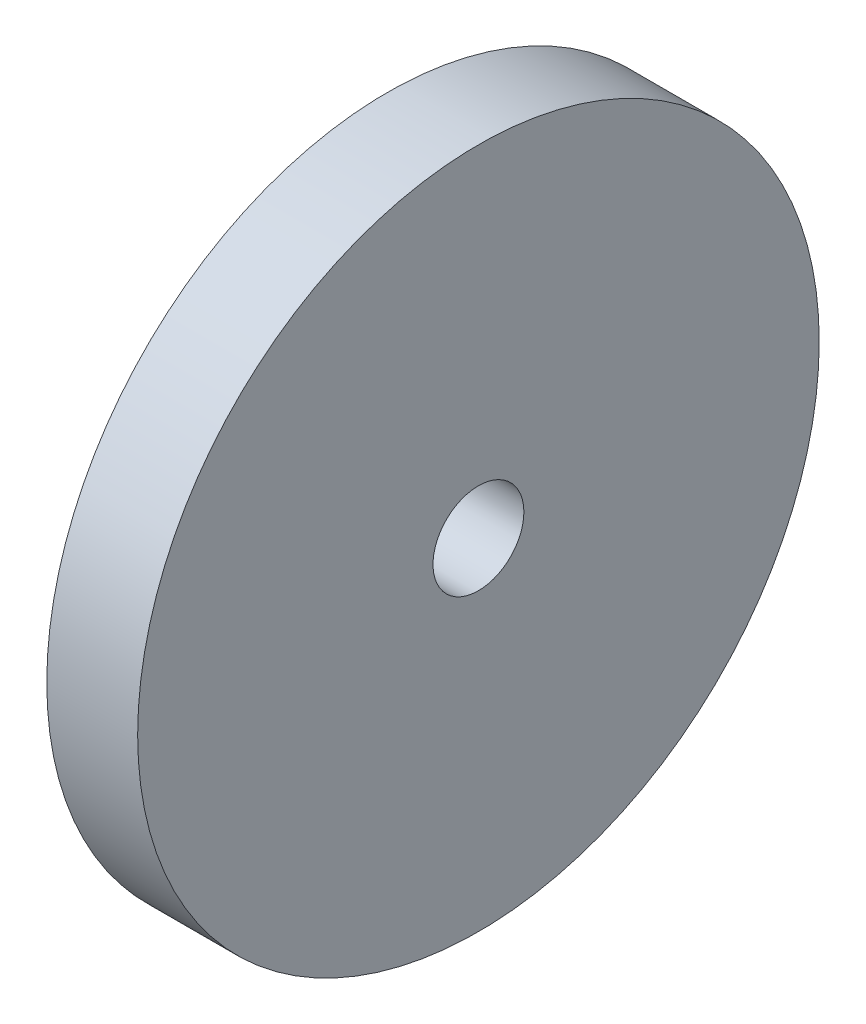
ISO-10303-21;
HEADER;
FILE_DESCRIPTION(('STEP AP214'),'2;1');
FILE_NAME('part.step','',(''),(''),'','','');
FILE_SCHEMA(('AUTOMOTIVE_DESIGN { 1 0 10303 214 1 1 1 1 }'));
ENDSEC;
DATA;
#1=APPLICATION_CONTEXT('core data for automotive mechanical design processes');
#2=APPLICATION_PROTOCOL_DEFINITION('international standard','automotive_design',2000,#1);
#3=PRODUCT_CONTEXT('',#1,'mechanical');
#4=PRODUCT('Part','Part','',(#3));
#5=PRODUCT_RELATED_PRODUCT_CATEGORY('part','',(#4));
#6=PRODUCT_DEFINITION_FORMATION('','',#4);
#7=PRODUCT_DEFINITION_CONTEXT('part definition',#1,'design');
#8=PRODUCT_DEFINITION('design','',#6,#7);
#9=PRODUCT_DEFINITION_SHAPE('','',#8);
#10=(LENGTH_UNIT() NAMED_UNIT(*) SI_UNIT(.MILLI.,.METRE.));
#11=(NAMED_UNIT(*) PLANE_ANGLE_UNIT() SI_UNIT($,.RADIAN.));
#12=(NAMED_UNIT(*) SI_UNIT($,.STERADIAN.) SOLID_ANGLE_UNIT());
#13=UNCERTAINTY_MEASURE_WITH_UNIT(LENGTH_MEASURE(1.E-05),#10,'distance_accuracy_value','');
#14=(GEOMETRIC_REPRESENTATION_CONTEXT(3) GLOBAL_UNCERTAINTY_ASSIGNED_CONTEXT((#13)) GLOBAL_UNIT_ASSIGNED_CONTEXT((#10,
#11,#12)) REPRESENTATION_CONTEXT('',''));
#15=CARTESIAN_POINT('',(0.,0.,0.));
#16=DIRECTION('',(0.,0.,1.));
#17=DIRECTION('',(1.,0.,0.));
#18=AXIS2_PLACEMENT_3D('',#15,#16,#17);
#19=CARTESIAN_POINT('',(8.,0.,0.));
#20=DIRECTION('',(-1.,0.,0.));
#21=DIRECTION('',(0.,0.,1.));
#22=AXIS2_PLACEMENT_3D('',#19,#20,#21);
#23=CYLINDRICAL_SURFACE('',#22,30.);
#24=CARTESIAN_POINT('',(8.,0.,0.));
#25=DIRECTION('',(1.,0.,0.));
#26=DIRECTION('',(0.,0.,-1.));
#27=AXIS2_PLACEMENT_3D('',#24,#25,#26);
#28=CIRCLE('',#27,30.);
#29=CARTESIAN_POINT('',(8.,0.,-30.));
#30=VERTEX_POINT('',#29);
#31=EDGE_CURVE('E10',#30,#30,#28,.T.);
#32=ORIENTED_EDGE('',*,*,#31,.F.);
#33=EDGE_LOOP('',(#32));
#34=FACE_BOUND('',#33,.T.);
#35=CARTESIAN_POINT('',(0.,0.,0.));
#36=DIRECTION('',(1.,0.,0.));
#37=DIRECTION('',(0.,0.,-1.));
#38=AXIS2_PLACEMENT_3D('',#35,#36,#37);
#39=CIRCLE('',#38,30.);
#40=CARTESIAN_POINT('',(0.,0.,-30.));
#41=VERTEX_POINT('',#40);
#42=EDGE_CURVE('E35',#41,#41,#39,.T.);
#43=ORIENTED_EDGE('',*,*,#42,.T.);
#44=EDGE_LOOP('',(#43));
#45=FACE_BOUND('',#44,.T.);
#46=ADVANCED_FACE('F32',(#34,#45),#23,.T.);
#47=CARTESIAN_POINT('',(8.,0.,0.));
#48=DIRECTION('',(1.,0.,0.));
#49=DIRECTION('',(0.,0.,-1.));
#50=AXIS2_PLACEMENT_3D('',#47,#48,#49);
#51=PLANE('',#50);
#52=CARTESIAN_POINT('',(8.,0.,0.));
#53=DIRECTION('',(1.,0.,0.));
#54=DIRECTION('',(0.,0.,-1.));
#55=AXIS2_PLACEMENT_3D('',#52,#53,#54);
#56=CIRCLE('',#55,4.);
#57=CARTESIAN_POINT('',(8.,0.,-4.));
#58=VERTEX_POINT('',#57);
#59=EDGE_CURVE('E44',#58,#58,#56,.T.);
#60=ORIENTED_EDGE('',*,*,#59,.F.);
#61=EDGE_LOOP('',(#60));
#62=FACE_BOUND('',#61,.T.);
#63=ORIENTED_EDGE('',*,*,#31,.T.);
#64=EDGE_LOOP('',(#63));
#65=FACE_BOUND('',#64,.T.);
#66=ADVANCED_FACE('F59',(#62,#65),#51,.T.);
#67=CARTESIAN_POINT('',(0.,0.,0.));
#68=DIRECTION('',(1.,0.,0.));
#69=DIRECTION('',(0.,0.,-1.));
#70=AXIS2_PLACEMENT_3D('',#67,#68,#69);
#71=PLANE('',#70);
#72=CARTESIAN_POINT('',(0.,0.,0.));
#73=DIRECTION('',(1.,0.,0.));
#74=DIRECTION('',(0.,0.,-1.));
#75=AXIS2_PLACEMENT_3D('',#72,#73,#74);
#76=CIRCLE('',#75,4.);
#77=CARTESIAN_POINT('',(0.,0.,-4.));
#78=VERTEX_POINT('',#77);
#79=EDGE_CURVE('E42',#78,#78,#76,.T.);
#80=ORIENTED_EDGE('',*,*,#79,.T.);
#81=EDGE_LOOP('',(#80));
#82=FACE_BOUND('',#81,.T.);
#83=ORIENTED_EDGE('',*,*,#42,.F.);
#84=EDGE_LOOP('',(#83));
#85=FACE_BOUND('',#84,.T.);
#86=ADVANCED_FACE('F50',(#82,#85),#71,.F.);
#87=CARTESIAN_POINT('',(0.,0.,0.));
#88=DIRECTION('',(1.,0.,0.));
#89=DIRECTION('',(0.,0.,-1.));
#90=AXIS2_PLACEMENT_3D('',#87,#88,#89);
#91=CYLINDRICAL_SURFACE('',#90,4.);
#92=ORIENTED_EDGE('',*,*,#79,.F.);
#93=EDGE_LOOP('',(#92));
#94=FACE_BOUND('',#93,.T.);
#95=ORIENTED_EDGE('',*,*,#59,.T.);
#96=EDGE_LOOP('',(#95));
#97=FACE_BOUND('',#96,.T.);
#98=ADVANCED_FACE('F53',(#94,#97),#91,.F.);
#99=CLOSED_SHELL('',(#46,#66,#86,#98));
#100=MANIFOLD_SOLID_BREP('B2',#99);
#101=ADVANCED_BREP_SHAPE_REPRESENTATION('',(#18,#100),#14);
#102=SHAPE_DEFINITION_REPRESENTATION(#9,#101);
ENDSEC;
END-ISO-10303-21;
